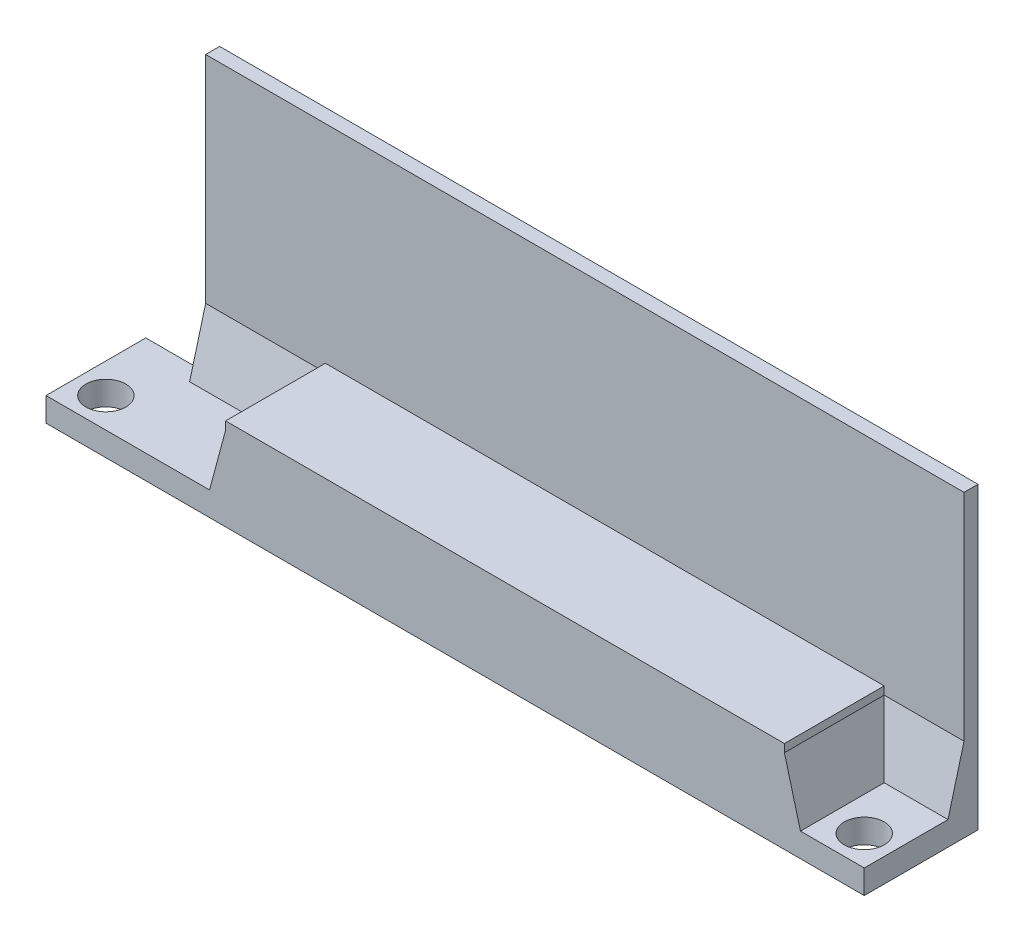
ISO-10303-21;
HEADER;
FILE_DESCRIPTION(('STEP AP214'),'2;1');
FILE_NAME('part.step','',(''),(''),'','','');
FILE_SCHEMA(('AUTOMOTIVE_DESIGN { 1 0 10303 214 1 1 1 1 }'));
ENDSEC;
DATA;
#1=APPLICATION_CONTEXT('core data for automotive mechanical design processes');
#2=APPLICATION_PROTOCOL_DEFINITION('international standard','automotive_design',2000,#1);
#3=PRODUCT_CONTEXT('',#1,'mechanical');
#4=PRODUCT('Part','Part','',(#3));
#5=PRODUCT_RELATED_PRODUCT_CATEGORY('part','',(#4));
#6=PRODUCT_DEFINITION_FORMATION('','',#4);
#7=PRODUCT_DEFINITION_CONTEXT('part definition',#1,'design');
#8=PRODUCT_DEFINITION('design','',#6,#7);
#9=PRODUCT_DEFINITION_SHAPE('','',#8);
#10=(LENGTH_UNIT() NAMED_UNIT(*) SI_UNIT(.MILLI.,.METRE.));
#11=(NAMED_UNIT(*) PLANE_ANGLE_UNIT() SI_UNIT($,.RADIAN.));
#12=(NAMED_UNIT(*) SI_UNIT($,.STERADIAN.) SOLID_ANGLE_UNIT());
#13=UNCERTAINTY_MEASURE_WITH_UNIT(LENGTH_MEASURE(1.E-05),#10,'distance_accuracy_value','');
#14=(GEOMETRIC_REPRESENTATION_CONTEXT(3) GLOBAL_UNCERTAINTY_ASSIGNED_CONTEXT((#13)) GLOBAL_UNIT_ASSIGNED_CONTEXT((#10,
#11,#12)) REPRESENTATION_CONTEXT('',''));
#15=CARTESIAN_POINT('',(0.,0.,0.));
#16=DIRECTION('',(0.,0.,1.));
#17=DIRECTION('',(1.,0.,0.));
#18=AXIS2_PLACEMENT_3D('',#15,#16,#17);
#19=CARTESIAN_POINT('',(9.8,0.,-9.99999999999999));
#20=DIRECTION('',(-1.,0.,0.));
#21=DIRECTION('',(0.,0.,1.));
#22=AXIS2_PLACEMENT_3D('',#19,#20,#21);
#23=PLANE('',#22);
#24=DIRECTION('',(0.,-1.,0.));
#25=VECTOR('',#24,1.);
#26=CARTESIAN_POINT('',(9.8,3.8,-0.799999999999995));
#27=LINE('',#26,#25);
#28=CARTESIAN_POINT('',(9.8,3.8,-0.799999999999995));
#29=VERTEX_POINT('',#28);
#30=CARTESIAN_POINT('',(9.8,0.,-0.799999999999995));
#31=VERTEX_POINT('',#30);
#32=EDGE_CURVE('E74',#29,#31,#27,.T.);
#33=ORIENTED_EDGE('',*,*,#32,.T.);
#34=DIRECTION('',(0.,0.,1.));
#35=VECTOR('',#34,1.);
#36=CARTESIAN_POINT('',(9.8,0.,-9.99999999999999));
#37=LINE('',#36,#35);
#38=CARTESIAN_POINT('',(9.8,0.,-5.70000000000001));
#39=VERTEX_POINT('',#38);
#40=EDGE_CURVE('E188',#39,#31,#37,.T.);
#41=ORIENTED_EDGE('',*,*,#40,.F.);
#42=DIRECTION('',(0.,1.,0.));
#43=VECTOR('',#42,1.);
#44=CARTESIAN_POINT('',(9.8,0.,-5.7));
#45=LINE('',#44,#43);
#46=CARTESIAN_POINT('',(9.8,3.8,-5.70000000000001));
#47=VERTEX_POINT('',#46);
#48=EDGE_CURVE('E190',#39,#47,#45,.T.);
#49=ORIENTED_EDGE('',*,*,#48,.T.);
#50=DIRECTION('',(0.,0.,1.));
#51=VECTOR('',#50,1.);
#52=CARTESIAN_POINT('',(9.8,3.8,-9.99999999999999));
#53=LINE('',#52,#51);
#54=EDGE_CURVE('E241',#47,#29,#53,.T.);
#55=ORIENTED_EDGE('',*,*,#54,.T.);
#56=EDGE_LOOP('',(#33,#41,#49,#55));
#57=FACE_BOUND('',#56,.T.);
#58=ADVANCED_FACE('F55',(#57),#23,.F.);
#59=CARTESIAN_POINT('',(9.8,3.8,-9.99999999999999));
#60=DIRECTION('',(0.,1.,0.));
#61=DIRECTION('',(0.,0.,1.));
#62=AXIS2_PLACEMENT_3D('',#59,#60,#61);
#63=PLANE('',#62);
#64=DIRECTION('',(-1.,0.,0.));
#65=VECTOR('',#64,1.);
#66=CARTESIAN_POINT('',(9.8,3.8,-0.799999999999995));
#67=LINE('',#66,#65);
#68=CARTESIAN_POINT('',(36.2,3.8,-0.799999999999995));
#69=VERTEX_POINT('',#68);
#70=EDGE_CURVE('E82',#69,#29,#67,.T.);
#71=ORIENTED_EDGE('',*,*,#70,.T.);
#72=ORIENTED_EDGE('',*,*,#54,.F.);
#73=DIRECTION('',(1.,0.,0.));
#74=VECTOR('',#73,1.);
#75=CARTESIAN_POINT('',(0.,3.8,-5.7));
#76=LINE('',#75,#74);
#77=CARTESIAN_POINT('',(36.2,3.8,-5.70000000000001));
#78=VERTEX_POINT('',#77);
#79=EDGE_CURVE('E206',#47,#78,#76,.T.);
#80=ORIENTED_EDGE('',*,*,#79,.T.);
#81=DIRECTION('',(0.,0.,1.));
#82=VECTOR('',#81,1.);
#83=CARTESIAN_POINT('',(36.2,3.8,-9.99999999999999));
#84=LINE('',#83,#82);
#85=EDGE_CURVE('E406',#78,#69,#84,.T.);
#86=ORIENTED_EDGE('',*,*,#85,.T.);
#87=EDGE_LOOP('',(#71,#72,#80,#86));
#88=FACE_BOUND('',#87,.T.);
#89=ADVANCED_FACE('F431',(#88),#63,.F.);
#90=CARTESIAN_POINT('',(36.2,0.,-9.99999999999999));
#91=DIRECTION('',(1.,0.,0.));
#92=DIRECTION('',(0.,0.,-1.));
#93=AXIS2_PLACEMENT_3D('',#90,#91,#92);
#94=PLANE('',#93);
#95=DIRECTION('',(0.,1.,0.));
#96=VECTOR('',#95,1.);
#97=CARTESIAN_POINT('',(36.2,3.8,-0.799999999999995));
#98=LINE('',#97,#96);
#99=CARTESIAN_POINT('',(36.2,0.,-0.799999999999995));
#100=VERTEX_POINT('',#99);
#101=EDGE_CURVE('E396',#100,#69,#98,.T.);
#102=ORIENTED_EDGE('',*,*,#101,.T.);
#103=ORIENTED_EDGE('',*,*,#85,.F.);
#104=DIRECTION('',(0.,-1.,0.));
#105=VECTOR('',#104,1.);
#106=CARTESIAN_POINT('',(36.2,0.,-5.70000000000001));
#107=LINE('',#106,#105);
#108=CARTESIAN_POINT('',(36.2,0.,-5.70000000000001));
#109=VERTEX_POINT('',#108);
#110=EDGE_CURVE('E340',#78,#109,#107,.T.);
#111=ORIENTED_EDGE('',*,*,#110,.T.);
#112=DIRECTION('',(0.,0.,1.));
#113=VECTOR('',#112,1.);
#114=CARTESIAN_POINT('',(36.2,0.,-9.99999999999999));
#115=LINE('',#114,#113);
#116=EDGE_CURVE('E196',#109,#100,#115,.T.);
#117=ORIENTED_EDGE('',*,*,#116,.T.);
#118=EDGE_LOOP('',(#102,#103,#111,#117));
#119=FACE_BOUND('',#118,.T.);
#120=ADVANCED_FACE('F413',(#119),#94,.F.);
#121=CARTESIAN_POINT('',(0.,10.,-5.));
#122=DIRECTION('',(0.,0.,1.));
#123=DIRECTION('',(1.,0.,0.));
#124=AXIS2_PLACEMENT_3D('',#121,#122,#123);
#125=PLANE('',#124);
#126=DIRECTION('',(0.,1.,0.));
#127=VECTOR('',#126,1.);
#128=CARTESIAN_POINT('',(3.,15.,-5.));
#129=LINE('',#128,#127);
#130=CARTESIAN_POINT('',(3.,0.,-5.));
#131=VERTEX_POINT('',#130);
#132=CARTESIAN_POINT('',(3.,1.2,-5.));
#133=VERTEX_POINT('',#132);
#134=EDGE_CURVE('E242',#131,#133,#129,.T.);
#135=ORIENTED_EDGE('',*,*,#134,.F.);
#136=DIRECTION('',(-1.,0.,0.));
#137=VECTOR('',#136,1.);
#138=CARTESIAN_POINT('',(0.,0.,-5.));
#139=LINE('',#138,#137);
#140=CARTESIAN_POINT('',(0.,0.,-5.));
#141=VERTEX_POINT('',#140);
#142=EDGE_CURVE('E310',#131,#141,#139,.T.);
#143=ORIENTED_EDGE('',*,*,#142,.T.);
#144=DIRECTION('',(0.,-1.,0.));
#145=VECTOR('',#144,1.);
#146=CARTESIAN_POINT('',(0.,10.,-5.));
#147=LINE('',#146,#145);
#148=CARTESIAN_POINT('',(0.,1.2,-5.));
#149=VERTEX_POINT('',#148);
#150=EDGE_CURVE('E313',#149,#141,#147,.T.);
#151=ORIENTED_EDGE('',*,*,#150,.F.);
#152=DIRECTION('',(1.,0.,0.));
#153=VECTOR('',#152,1.);
#154=CARTESIAN_POINT('',(0.,1.2,-5.));
#155=LINE('',#154,#153);
#156=EDGE_CURVE('E287',#149,#133,#155,.T.);
#157=ORIENTED_EDGE('',*,*,#156,.T.);
#158=EDGE_LOOP('',(#135,#143,#151,#157));
#159=FACE_BOUND('',#158,.T.);
#160=ADVANCED_FACE('F482',(#159),#125,.F.);
#161=CARTESIAN_POINT('',(0.,0.,0.));
#162=DIRECTION('',(0.,-1.,0.));
#163=DIRECTION('',(0.,0.,-1.));
#164=AXIS2_PLACEMENT_3D('',#161,#162,#163);
#165=PLANE('',#164);
#166=ORIENTED_EDGE('',*,*,#116,.F.);
#167=DIRECTION('',(-1.,0.,0.));
#168=VECTOR('',#167,1.);
#169=CARTESIAN_POINT('',(41.,0.,-5.70000000000001));
#170=LINE('',#169,#168);
#171=CARTESIAN_POINT('',(41.,0.,-5.70000000000001));
#172=VERTEX_POINT('',#171);
#173=EDGE_CURVE('E218',#172,#109,#170,.T.);
#174=ORIENTED_EDGE('',*,*,#173,.F.);
#175=DIRECTION('',(0.,0.,-1.));
#176=VECTOR('',#175,1.);
#177=CARTESIAN_POINT('',(41.,0.,0.));
#178=LINE('',#177,#176);
#179=CARTESIAN_POINT('',(41.,0.,0.));
#180=VERTEX_POINT('',#179);
#181=EDGE_CURVE('E307',#180,#172,#178,.T.);
#182=ORIENTED_EDGE('',*,*,#181,.F.);
#183=DIRECTION('',(1.,0.,0.));
#184=VECTOR('',#183,1.);
#185=CARTESIAN_POINT('',(0.,0.,0.));
#186=LINE('',#185,#184);
#187=CARTESIAN_POINT('',(0.,0.,0.));
#188=VERTEX_POINT('',#187);
#189=EDGE_CURVE('E304',#188,#180,#186,.T.);
#190=ORIENTED_EDGE('',*,*,#189,.F.);
#191=DIRECTION('',(0.,0.,1.));
#192=VECTOR('',#191,1.);
#193=CARTESIAN_POINT('',(0.,0.,0.));
#194=LINE('',#193,#192);
#195=EDGE_CURVE('E300',#141,#188,#194,.T.);
#196=ORIENTED_EDGE('',*,*,#195,.F.);
#197=ORIENTED_EDGE('',*,*,#142,.F.);
#198=DIRECTION('',(0.,0.,1.));
#199=VECTOR('',#198,1.);
#200=CARTESIAN_POINT('',(3.,0.,-5.7));
#201=LINE('',#200,#199);
#202=CARTESIAN_POINT('',(3.,0.,-5.7));
#203=VERTEX_POINT('',#202);
#204=EDGE_CURVE('E215',#203,#131,#201,.T.);
#205=ORIENTED_EDGE('',*,*,#204,.F.);
#206=EDGE_CURVE('E202',#39,#203,#170,.T.);
#207=ORIENTED_EDGE('',*,*,#206,.F.);
#208=ORIENTED_EDGE('',*,*,#40,.T.);
#209=DIRECTION('',(1.,0.,0.));
#210=VECTOR('',#209,1.);
#211=CARTESIAN_POINT('',(9.8,0.,-0.799999999999995));
#212=LINE('',#211,#210);
#213=EDGE_CURVE('E400',#31,#100,#212,.T.);
#214=ORIENTED_EDGE('',*,*,#213,.T.);
#215=EDGE_LOOP('',(#166,#174,#182,#190,#196,#197,#205,#207,#208,#214));
#216=FACE_BOUND('',#215,.T.);
#217=CARTESIAN_POINT('',(39.5,0.,-1.5));
#218=DIRECTION('',(0.,1.,0.));
#219=DIRECTION('',(0.,0.,-1.));
#220=AXIS2_PLACEMENT_3D('',#217,#218,#219);
#221=CIRCLE('',#220,1.00000000000001);
#222=CARTESIAN_POINT('',(39.5,0.,-2.50000000000001));
#223=VERTEX_POINT('',#222);
#224=EDGE_CURVE('E291',#223,#223,#221,.T.);
#225=ORIENTED_EDGE('',*,*,#224,.T.);
#226=EDGE_LOOP('',(#225));
#227=FACE_BOUND('',#226,.T.);
#228=CARTESIAN_POINT('',(1.5,0.,-1.5));
#229=DIRECTION('',(0.,1.,0.));
#230=DIRECTION('',(0.,0.,1.));
#231=AXIS2_PLACEMENT_3D('',#228,#229,#230);
#232=CIRCLE('',#231,1.);
#233=CARTESIAN_POINT('',(1.5,0.,-0.500000000000001));
#234=VERTEX_POINT('',#233);
#235=EDGE_CURVE('E296',#234,#234,#232,.T.);
#236=ORIENTED_EDGE('',*,*,#235,.T.);
#237=EDGE_LOOP('',(#236));
#238=FACE_BOUND('',#237,.T.);
#239=ADVANCED_FACE('F211',(#216,#227,#238),#165,.T.);
#240=CARTESIAN_POINT('',(0.,10.,0.));
#241=DIRECTION('',(1.,0.,0.));
#242=DIRECTION('',(0.,0.,-1.));
#243=AXIS2_PLACEMENT_3D('',#240,#241,#242);
#244=PLANE('',#243);
#245=DIRECTION('',(0.,-1.,0.));
#246=VECTOR('',#245,1.);
#247=CARTESIAN_POINT('',(0.,10.,0.));
#248=LINE('',#247,#246);
#249=CARTESIAN_POINT('',(0.,1.2,0.));
#250=VERTEX_POINT('',#249);
#251=EDGE_CURVE('E321',#250,#188,#248,.T.);
#252=ORIENTED_EDGE('',*,*,#251,.F.);
#253=DIRECTION('',(0.,0.,1.));
#254=VECTOR('',#253,1.);
#255=CARTESIAN_POINT('',(0.,1.2,-9.99999999999999));
#256=LINE('',#255,#254);
#257=EDGE_CURVE('E282',#149,#250,#256,.T.);
#258=ORIENTED_EDGE('',*,*,#257,.F.);
#259=ORIENTED_EDGE('',*,*,#150,.T.);
#260=ORIENTED_EDGE('',*,*,#195,.T.);
#261=EDGE_LOOP('',(#252,#258,#259,#260));
#262=FACE_BOUND('',#261,.T.);
#263=ADVANCED_FACE('F481',(#262),#244,.F.);
#264=CARTESIAN_POINT('',(0.,10.,0.));
#265=DIRECTION('',(0.,0.,-1.));
#266=DIRECTION('',(-1.,0.,0.));
#267=AXIS2_PLACEMENT_3D('',#264,#265,#266);
#268=PLANE('',#267);
#269=ORIENTED_EDGE('',*,*,#189,.T.);
#270=DIRECTION('',(0.,-1.,0.));
#271=VECTOR('',#270,1.);
#272=CARTESIAN_POINT('',(41.,10.,0.));
#273=LINE('',#272,#271);
#274=CARTESIAN_POINT('',(41.,1.2,0.));
#275=VERTEX_POINT('',#274);
#276=EDGE_CURVE('E317',#275,#180,#273,.T.);
#277=ORIENTED_EDGE('',*,*,#276,.F.);
#278=DIRECTION('',(1.,0.,0.));
#279=VECTOR('',#278,1.);
#280=CARTESIAN_POINT('',(0.,1.2,0.));
#281=LINE('',#280,#279);
#282=CARTESIAN_POINT('',(37.8038475772934,1.2,0.));
#283=VERTEX_POINT('',#282);
#284=EDGE_CURVE('E260',#283,#275,#281,.T.);
#285=ORIENTED_EDGE('',*,*,#284,.F.);
#286=DIRECTION('',(-0.258819045102527,0.965925826289067,0.));
#287=VECTOR('',#286,1.);
#288=CARTESIAN_POINT('',(33.071469970012,18.8614736709751,0.));
#289=LINE('',#288,#287);
#290=CARTESIAN_POINT('',(37.,4.19999999999995,0.));
#291=VERTEX_POINT('',#290);
#292=EDGE_CURVE('E377',#283,#291,#289,.T.);
#293=ORIENTED_EDGE('',*,*,#292,.T.);
#294=DIRECTION('',(0.,1.,0.));
#295=VECTOR('',#294,1.);
#296=CARTESIAN_POINT('',(37.,0.,0.));
#297=LINE('',#296,#295);
#298=CARTESIAN_POINT('',(37.,4.6,0.));
#299=VERTEX_POINT('',#298);
#300=EDGE_CURVE('E257',#291,#299,#297,.T.);
#301=ORIENTED_EDGE('',*,*,#300,.T.);
#302=DIRECTION('',(1.,0.,0.));
#303=VECTOR('',#302,1.);
#304=CARTESIAN_POINT('',(0.,4.6,0.));
#305=LINE('',#304,#303);
#306=CARTESIAN_POINT('',(9.00000000000001,4.6,0.));
#307=VERTEX_POINT('',#306);
#308=EDGE_CURVE('E268',#307,#299,#305,.T.);
#309=ORIENTED_EDGE('',*,*,#308,.F.);
#310=DIRECTION('',(0.,1.,0.));
#311=VECTOR('',#310,1.);
#312=CARTESIAN_POINT('',(9.00000000000001,0.,0.));
#313=LINE('',#312,#311);
#314=CARTESIAN_POINT('',(9.00000000000001,4.19999999999996,0.));
#315=VERTEX_POINT('',#314);
#316=EDGE_CURVE('E265',#315,#307,#313,.T.);
#317=ORIENTED_EDGE('',*,*,#316,.F.);
#318=DIRECTION('',(0.258819045102524,0.965925826289068,0.));
#319=VECTOR('',#318,1.);
#320=CARTESIAN_POINT('',(9.84711431702999,7.36147367097483,0.));
#321=LINE('',#320,#319);
#322=CARTESIAN_POINT('',(8.19615242270664,1.2,0.));
#323=VERTEX_POINT('',#322);
#324=EDGE_CURVE('E14',#315,#323,#321,.F.);
#325=ORIENTED_EDGE('',*,*,#324,.T.);
#326=EDGE_CURVE('E264',#250,#323,#281,.T.);
#327=ORIENTED_EDGE('',*,*,#326,.F.);
#328=ORIENTED_EDGE('',*,*,#251,.T.);
#329=EDGE_LOOP('',(#269,#277,#285,#293,#301,#309,#317,#325,#327,#328));
#330=FACE_BOUND('',#329,.T.);
#331=ADVANCED_FACE('F488',(#330),#268,.F.);
#332=CARTESIAN_POINT('',(41.,10.,0.));
#333=DIRECTION('',(-1.,0.,0.));
#334=DIRECTION('',(0.,0.,1.));
#335=AXIS2_PLACEMENT_3D('',#332,#333,#334);
#336=PLANE('',#335);
#337=ORIENTED_EDGE('',*,*,#181,.T.);
#338=DIRECTION('',(0.,-1.,0.));
#339=VECTOR('',#338,1.);
#340=CARTESIAN_POINT('',(41.,15.,-5.70000000000001));
#341=LINE('',#340,#339);
#342=CARTESIAN_POINT('',(41.,15.,-5.70000000000001));
#343=VERTEX_POINT('',#342);
#344=EDGE_CURVE('E219',#343,#172,#341,.T.);
#345=ORIENTED_EDGE('',*,*,#344,.F.);
#346=DIRECTION('',(0.,0.,1.));
#347=VECTOR('',#346,1.);
#348=CARTESIAN_POINT('',(41.,15.,-5.70000000000001));
#349=LINE('',#348,#347);
#350=CARTESIAN_POINT('',(41.,15.,-5.));
#351=VERTEX_POINT('',#350);
#352=EDGE_CURVE('E235',#343,#351,#349,.T.);
#353=ORIENTED_EDGE('',*,*,#352,.T.);
#354=DIRECTION('',(0.,-1.,0.));
#355=VECTOR('',#354,1.);
#356=CARTESIAN_POINT('',(41.,15.,-5.));
#357=LINE('',#356,#355);
#358=CARTESIAN_POINT('',(41.,4.19999999999995,-5.));
#359=VERTEX_POINT('',#358);
#360=EDGE_CURVE('E236',#351,#359,#357,.T.);
#361=ORIENTED_EDGE('',*,*,#360,.T.);
#362=DIRECTION('',(0.,0.965925826289067,-0.258819045102527));
#363=VECTOR('',#362,1.);
#364=CARTESIAN_POINT('',(41.,8.36147367097483,-6.11506350946113));
#365=LINE('',#364,#363);
#366=CARTESIAN_POINT('',(41.,1.2,-4.19615242270663));
#367=VERTEX_POINT('',#366);
#368=EDGE_CURVE('E374',#359,#367,#365,.F.);
#369=ORIENTED_EDGE('',*,*,#368,.T.);
#370=DIRECTION('',(0.,0.,1.));
#371=VECTOR('',#370,1.);
#372=CARTESIAN_POINT('',(41.,1.2,-9.99999999999999));
#373=LINE('',#372,#371);
#374=EDGE_CURVE('E272',#367,#275,#373,.T.);
#375=ORIENTED_EDGE('',*,*,#374,.T.);
#376=ORIENTED_EDGE('',*,*,#276,.T.);
#377=EDGE_LOOP('',(#337,#345,#353,#361,#369,#375,#376));
#378=FACE_BOUND('',#377,.T.);
#379=ADVANCED_FACE('F477',(#378),#336,.F.);
#380=CARTESIAN_POINT('',(1.5,10.,-1.5));
#381=DIRECTION('',(0.,-1.,0.));
#382=DIRECTION('',(0.,0.,-1.));
#383=AXIS2_PLACEMENT_3D('',#380,#381,#382);
#384=CYLINDRICAL_SURFACE('',#383,1.);
#385=CARTESIAN_POINT('',(1.5,1.2,-1.5));
#386=DIRECTION('',(0.,-1.,0.));
#387=DIRECTION('',(0.,0.,-1.));
#388=AXIS2_PLACEMENT_3D('',#385,#386,#387);
#389=CIRCLE('',#388,1.);
#390=CARTESIAN_POINT('',(1.5,1.2,-2.5));
#391=VERTEX_POINT('',#390);
#392=EDGE_CURVE('E292',#391,#391,#389,.T.);
#393=ORIENTED_EDGE('',*,*,#392,.F.);
#394=EDGE_LOOP('',(#393));
#395=FACE_BOUND('',#394,.T.);
#396=ORIENTED_EDGE('',*,*,#235,.F.);
#397=EDGE_LOOP('',(#396));
#398=FACE_BOUND('',#397,.T.);
#399=ADVANCED_FACE('F473',(#395,#398),#384,.F.);
#400=CARTESIAN_POINT('',(39.5,10.,-1.5));
#401=DIRECTION('',(0.,-1.,0.));
#402=DIRECTION('',(0.,0.,-1.));
#403=AXIS2_PLACEMENT_3D('',#400,#401,#402);
#404=CYLINDRICAL_SURFACE('',#403,1.00000000000001);
#405=CARTESIAN_POINT('',(39.5,1.2,-1.5));
#406=DIRECTION('',(0.,-1.,0.));
#407=DIRECTION('',(0.,0.,-1.));
#408=AXIS2_PLACEMENT_3D('',#405,#406,#407);
#409=CIRCLE('',#408,1.00000000000001);
#410=CARTESIAN_POINT('',(39.5,1.2,-2.50000000000001));
#411=VERTEX_POINT('',#410);
#412=EDGE_CURVE('E277',#411,#411,#409,.T.);
#413=ORIENTED_EDGE('',*,*,#412,.F.);
#414=EDGE_LOOP('',(#413));
#415=FACE_BOUND('',#414,.T.);
#416=ORIENTED_EDGE('',*,*,#224,.F.);
#417=EDGE_LOOP('',(#416));
#418=FACE_BOUND('',#417,.T.);
#419=ADVANCED_FACE('F469',(#415,#418),#404,.F.);
#420=CARTESIAN_POINT('',(37.,0.,-9.99999999999999));
#421=DIRECTION('',(1.,0.,0.));
#422=DIRECTION('',(0.,0.,-1.));
#423=AXIS2_PLACEMENT_3D('',#420,#421,#422);
#424=PLANE('',#423);
#425=ORIENTED_EDGE('',*,*,#300,.F.);
#426=DIRECTION('',(0.,0.,-1.));
#427=VECTOR('',#426,1.);
#428=CARTESIAN_POINT('',(37.,4.19999999999995,-9.99999999999999));
#429=LINE('',#428,#427);
#430=CARTESIAN_POINT('',(37.,4.19999999999995,-5.));
#431=VERTEX_POINT('',#430);
#432=EDGE_CURVE('E358',#291,#431,#429,.T.);
#433=ORIENTED_EDGE('',*,*,#432,.T.);
#434=DIRECTION('',(0.,1.,0.));
#435=VECTOR('',#434,1.);
#436=CARTESIAN_POINT('',(37.,10.,-5.));
#437=LINE('',#436,#435);
#438=CARTESIAN_POINT('',(37.,4.6,-5.));
#439=VERTEX_POINT('',#438);
#440=EDGE_CURVE('E324',#431,#439,#437,.T.);
#441=ORIENTED_EDGE('',*,*,#440,.T.);
#442=DIRECTION('',(0.,0.,1.));
#443=VECTOR('',#442,1.);
#444=CARTESIAN_POINT('',(37.,4.6,-9.99999999999999));
#445=LINE('',#444,#443);
#446=EDGE_CURVE('E273',#439,#299,#445,.T.);
#447=ORIENTED_EDGE('',*,*,#446,.T.);
#448=EDGE_LOOP('',(#425,#433,#441,#447));
#449=FACE_BOUND('',#448,.T.);
#450=ADVANCED_FACE('F458',(#449),#424,.T.);
#451=CARTESIAN_POINT('',(0.,4.6,-9.99999999999999));
#452=DIRECTION('',(0.,-1.,0.));
#453=DIRECTION('',(0.,0.,-1.));
#454=AXIS2_PLACEMENT_3D('',#451,#452,#453);
#455=PLANE('',#454);
#456=DIRECTION('',(0.,0.,1.));
#457=VECTOR('',#456,1.);
#458=CARTESIAN_POINT('',(9.00000000000001,4.6,-9.99999999999999));
#459=LINE('',#458,#457);
#460=CARTESIAN_POINT('',(9.00000000000001,4.6,-5.));
#461=VERTEX_POINT('',#460);
#462=EDGE_CURVE('E278',#461,#307,#459,.T.);
#463=ORIENTED_EDGE('',*,*,#462,.T.);
#464=ORIENTED_EDGE('',*,*,#308,.T.);
#465=ORIENTED_EDGE('',*,*,#446,.F.);
#466=DIRECTION('',(1.,0.,0.));
#467=VECTOR('',#466,1.);
#468=CARTESIAN_POINT('',(0.,4.6,-5.));
#469=LINE('',#468,#467);
#470=EDGE_CURVE('E333',#461,#439,#469,.T.);
#471=ORIENTED_EDGE('',*,*,#470,.F.);
#472=EDGE_LOOP('',(#463,#464,#465,#471));
#473=FACE_BOUND('',#472,.T.);
#474=ADVANCED_FACE('F454',(#473),#455,.F.);
#475=CARTESIAN_POINT('',(9.00000000000001,0.,-9.99999999999999));
#476=DIRECTION('',(1.,0.,0.));
#477=DIRECTION('',(0.,0.,-1.));
#478=AXIS2_PLACEMENT_3D('',#475,#476,#477);
#479=PLANE('',#478);
#480=DIRECTION('',(0.,1.,0.));
#481=VECTOR('',#480,1.);
#482=CARTESIAN_POINT('',(9.00000000000001,10.,-5.));
#483=LINE('',#482,#481);
#484=CARTESIAN_POINT('',(9.00000000000001,4.19999999999996,-5.));
#485=VERTEX_POINT('',#484);
#486=EDGE_CURVE('E337',#485,#461,#483,.T.);
#487=ORIENTED_EDGE('',*,*,#486,.F.);
#488=DIRECTION('',(0.,0.,1.));
#489=VECTOR('',#488,1.);
#490=CARTESIAN_POINT('',(9.00000000000001,4.19999999999996,0.));
#491=LINE('',#490,#489);
#492=EDGE_CURVE('E371',#485,#315,#491,.T.);
#493=ORIENTED_EDGE('',*,*,#492,.T.);
#494=ORIENTED_EDGE('',*,*,#316,.T.);
#495=ORIENTED_EDGE('',*,*,#462,.F.);
#496=EDGE_LOOP('',(#487,#493,#494,#495));
#497=FACE_BOUND('',#496,.T.);
#498=ADVANCED_FACE('F457',(#497),#479,.F.);
#499=CARTESIAN_POINT('',(0.,1.2,-9.99999999999999));
#500=DIRECTION('',(0.,-1.,0.));
#501=DIRECTION('',(0.,0.,-1.));
#502=AXIS2_PLACEMENT_3D('',#499,#500,#501);
#503=PLANE('',#502);
#504=ORIENTED_EDGE('',*,*,#392,.T.);
#505=EDGE_LOOP('',(#504));
#506=FACE_BOUND('',#505,.T.);
#507=DIRECTION('',(-1.,0.,0.));
#508=VECTOR('',#507,1.);
#509=CARTESIAN_POINT('',(3.,1.2,-4.19615242270663));
#510=LINE('',#509,#508);
#511=CARTESIAN_POINT('',(8.19615242270664,1.2,-4.19615242270663));
#512=VERTEX_POINT('',#511);
#513=CARTESIAN_POINT('',(3.,1.2,-4.19615242270663));
#514=VERTEX_POINT('',#513);
#515=EDGE_CURVE('E364',#512,#514,#510,.T.);
#516=ORIENTED_EDGE('',*,*,#515,.T.);
#517=DIRECTION('',(0.,0.,-1.));
#518=VECTOR('',#517,1.);
#519=CARTESIAN_POINT('',(3.,1.2,-5.7));
#520=LINE('',#519,#518);
#521=EDGE_CURVE('E368',#514,#133,#520,.T.);
#522=ORIENTED_EDGE('',*,*,#521,.T.);
#523=ORIENTED_EDGE('',*,*,#156,.F.);
#524=ORIENTED_EDGE('',*,*,#257,.T.);
#525=ORIENTED_EDGE('',*,*,#326,.T.);
#526=DIRECTION('',(0.,0.,-1.));
#527=VECTOR('',#526,1.);
#528=CARTESIAN_POINT('',(8.19615242270664,1.2,-5.));
#529=LINE('',#528,#527);
#530=EDGE_CURVE('E361',#323,#512,#529,.T.);
#531=ORIENTED_EDGE('',*,*,#530,.T.);
#532=EDGE_LOOP('',(#516,#522,#523,#524,#525,#531));
#533=FACE_BOUND('',#532,.T.);
#534=ADVANCED_FACE('F462',(#506,#533),#503,.F.);
#535=ORIENTED_EDGE('',*,*,#412,.T.);
#536=EDGE_LOOP('',(#535));
#537=FACE_BOUND('',#536,.T.);
#538=ORIENTED_EDGE('',*,*,#374,.F.);
#539=DIRECTION('',(-1.,0.,0.));
#540=VECTOR('',#539,1.);
#541=CARTESIAN_POINT('',(37.,1.2,-4.19615242270663));
#542=LINE('',#541,#540);
#543=CARTESIAN_POINT('',(37.8038475772934,1.2,-4.19615242270663));
#544=VERTEX_POINT('',#543);
#545=EDGE_CURVE('E355',#367,#544,#542,.T.);
#546=ORIENTED_EDGE('',*,*,#545,.T.);
#547=DIRECTION('',(0.,0.,1.));
#548=VECTOR('',#547,1.);
#549=CARTESIAN_POINT('',(37.8038475772934,1.2,-9.99999999999999));
#550=LINE('',#549,#548);
#551=EDGE_CURVE('E352',#544,#283,#550,.T.);
#552=ORIENTED_EDGE('',*,*,#551,.T.);
#553=ORIENTED_EDGE('',*,*,#284,.T.);
#554=EDGE_LOOP('',(#538,#546,#552,#553));
#555=FACE_BOUND('',#554,.T.);
#556=ADVANCED_FACE('F446',(#537,#555),#503,.F.);
#557=CARTESIAN_POINT('',(0.,0.,-5.));
#558=DIRECTION('',(0.,0.,-1.));
#559=DIRECTION('',(-1.,0.,0.));
#560=AXIS2_PLACEMENT_3D('',#557,#558,#559);
#561=PLANE('',#560);
#562=ORIENTED_EDGE('',*,*,#440,.F.);
#563=DIRECTION('',(1.,0.,0.));
#564=VECTOR('',#563,1.);
#565=CARTESIAN_POINT('',(41.,4.19999999999995,-5.));
#566=LINE('',#565,#564);
#567=EDGE_CURVE('E348',#431,#359,#566,.T.);
#568=ORIENTED_EDGE('',*,*,#567,.T.);
#569=ORIENTED_EDGE('',*,*,#360,.F.);
#570=DIRECTION('',(1.,0.,0.));
#571=VECTOR('',#570,1.);
#572=CARTESIAN_POINT('',(41.,15.,-5.));
#573=LINE('',#572,#571);
#574=CARTESIAN_POINT('',(3.,15.,-5.));
#575=VERTEX_POINT('',#574);
#576=EDGE_CURVE('E227',#575,#351,#573,.T.);
#577=ORIENTED_EDGE('',*,*,#576,.F.);
#578=CARTESIAN_POINT('',(3.,4.19999999999996,-5.));
#579=VERTEX_POINT('',#578);
#580=EDGE_CURVE('E240',#579,#575,#129,.T.);
#581=ORIENTED_EDGE('',*,*,#580,.F.);
#582=DIRECTION('',(1.,0.,0.));
#583=VECTOR('',#582,1.);
#584=CARTESIAN_POINT('',(9.00000000000001,4.19999999999996,-5.));
#585=LINE('',#584,#583);
#586=EDGE_CURVE('E208',#579,#485,#585,.T.);
#587=ORIENTED_EDGE('',*,*,#586,.T.);
#588=ORIENTED_EDGE('',*,*,#486,.T.);
#589=ORIENTED_EDGE('',*,*,#470,.T.);
#590=EDGE_LOOP('',(#562,#568,#569,#577,#581,#587,#588,#589));
#591=FACE_BOUND('',#590,.T.);
#592=ADVANCED_FACE('F442',(#591),#561,.F.);
#593=CARTESIAN_POINT('',(3.,15.,-5.7));
#594=DIRECTION('',(1.,0.,0.));
#595=DIRECTION('',(0.,0.,-1.));
#596=AXIS2_PLACEMENT_3D('',#593,#594,#595);
#597=PLANE('',#596);
#598=ORIENTED_EDGE('',*,*,#134,.T.);
#599=ORIENTED_EDGE('',*,*,#521,.F.);
#600=DIRECTION('',(0.,-0.965925826289068,0.258819045102524));
#601=VECTOR('',#600,1.);
#602=CARTESIAN_POINT('',(3.,14.4515371804359,-7.74689110867549));
#603=LINE('',#602,#601);
#604=EDGE_CURVE('E66',#514,#579,#603,.F.);
#605=ORIENTED_EDGE('',*,*,#604,.T.);
#606=ORIENTED_EDGE('',*,*,#580,.T.);
#607=DIRECTION('',(0.,0.,1.));
#608=VECTOR('',#607,1.);
#609=CARTESIAN_POINT('',(3.,15.,-5.7));
#610=LINE('',#609,#608);
#611=CARTESIAN_POINT('',(3.,15.,-5.7));
#612=VERTEX_POINT('',#611);
#613=EDGE_CURVE('E251',#612,#575,#610,.T.);
#614=ORIENTED_EDGE('',*,*,#613,.F.);
#615=DIRECTION('',(0.,1.,0.));
#616=VECTOR('',#615,1.);
#617=CARTESIAN_POINT('',(3.,15.,-5.7));
#618=LINE('',#617,#616);
#619=EDGE_CURVE('E225',#203,#612,#618,.T.);
#620=ORIENTED_EDGE('',*,*,#619,.F.);
#621=ORIENTED_EDGE('',*,*,#204,.T.);
#622=EDGE_LOOP('',(#598,#599,#605,#606,#614,#620,#621));
#623=FACE_BOUND('',#622,.T.);
#624=ADVANCED_FACE('F445',(#623),#597,.F.);
#625=CARTESIAN_POINT('',(41.,15.,-5.70000000000001));
#626=DIRECTION('',(0.,-1.,0.));
#627=DIRECTION('',(0.,0.,-1.));
#628=AXIS2_PLACEMENT_3D('',#625,#626,#627);
#629=PLANE('',#628);
#630=ORIENTED_EDGE('',*,*,#576,.T.);
#631=ORIENTED_EDGE('',*,*,#352,.F.);
#632=DIRECTION('',(1.,0.,0.));
#633=VECTOR('',#632,1.);
#634=CARTESIAN_POINT('',(41.,15.,-5.70000000000001));
#635=LINE('',#634,#633);
#636=EDGE_CURVE('E232',#612,#343,#635,.T.);
#637=ORIENTED_EDGE('',*,*,#636,.F.);
#638=ORIENTED_EDGE('',*,*,#613,.T.);
#639=EDGE_LOOP('',(#630,#631,#637,#638));
#640=FACE_BOUND('',#639,.T.);
#641=ADVANCED_FACE('F441',(#640),#629,.F.);
#642=CARTESIAN_POINT('',(0.,0.,-5.7));
#643=DIRECTION('',(0.,0.,-1.));
#644=DIRECTION('',(-1.,0.,0.));
#645=AXIS2_PLACEMENT_3D('',#642,#643,#644);
#646=PLANE('',#645);
#647=ORIENTED_EDGE('',*,*,#48,.F.);
#648=ORIENTED_EDGE('',*,*,#206,.T.);
#649=ORIENTED_EDGE('',*,*,#619,.T.);
#650=ORIENTED_EDGE('',*,*,#636,.T.);
#651=ORIENTED_EDGE('',*,*,#344,.T.);
#652=ORIENTED_EDGE('',*,*,#173,.T.);
#653=ORIENTED_EDGE('',*,*,#110,.F.);
#654=ORIENTED_EDGE('',*,*,#79,.F.);
#655=EDGE_LOOP('',(#647,#648,#649,#650,#651,#652,#653,#654));
#656=FACE_BOUND('',#655,.T.);
#657=ADVANCED_FACE('F201',(#656),#646,.T.);
#658=CARTESIAN_POINT('',(37.8038475772934,1.2,-9.99999999999999));
#659=DIRECTION('',(-0.965925826289067,-0.258819045102527,0.));
#660=DIRECTION('',(0.,0.,1.));
#661=AXIS2_PLACEMENT_3D('',#658,#659,#660);
#662=PLANE('',#661);
#663=ORIENTED_EDGE('',*,*,#292,.F.);
#664=ORIENTED_EDGE('',*,*,#551,.F.);
#665=DIRECTION('',(0.250562807085737,-0.935113126531026,0.250562807085737));
#666=VECTOR('',#665,1.);
#667=CARTESIAN_POINT('',(34.6770763490967,12.8692690872743,-7.32292365090333));
#668=LINE('',#667,#666);
#669=EDGE_CURVE('E197',#431,#544,#668,.T.);
#670=ORIENTED_EDGE('',*,*,#669,.F.);
#671=ORIENTED_EDGE('',*,*,#432,.F.);
#672=EDGE_LOOP('',(#663,#664,#670,#671));
#673=FACE_BOUND('',#672,.T.);
#674=ADVANCED_FACE('F440',(#673),#662,.F.);
#675=CARTESIAN_POINT('',(0.,4.19999999999995,-5.));
#676=DIRECTION('',(0.,0.258819045102527,0.965925826289067));
#677=DIRECTION('',(-1.,0.,0.));
#678=AXIS2_PLACEMENT_3D('',#675,#676,#677);
#679=PLANE('',#678);
#680=ORIENTED_EDGE('',*,*,#669,.T.);
#681=ORIENTED_EDGE('',*,*,#545,.F.);
#682=ORIENTED_EDGE('',*,*,#368,.F.);
#683=ORIENTED_EDGE('',*,*,#567,.F.);
#684=EDGE_LOOP('',(#680,#681,#682,#683));
#685=FACE_BOUND('',#684,.T.);
#686=ADVANCED_FACE('F497',(#685),#679,.T.);
#687=CARTESIAN_POINT('',(9.00000000000001,4.19999999999996,-9.99999999999999));
#688=DIRECTION('',(-0.965925826289067,0.258819045102524,0.));
#689=DIRECTION('',(0.,0.,-1.));
#690=AXIS2_PLACEMENT_3D('',#687,#688,#689);
#691=PLANE('',#690);
#692=ORIENTED_EDGE('',*,*,#324,.F.);
#693=ORIENTED_EDGE('',*,*,#492,.F.);
#694=DIRECTION('',(-0.250562807085735,-0.935113126531028,0.250562807085735));
#695=VECTOR('',#694,1.);
#696=CARTESIAN_POINT('',(8.43496451734786,2.09125887066297,-4.43496451734786));
#697=LINE('',#696,#695);
#698=EDGE_CURVE('E60',#512,#485,#697,.F.);
#699=ORIENTED_EDGE('',*,*,#698,.F.);
#700=ORIENTED_EDGE('',*,*,#530,.F.);
#701=EDGE_LOOP('',(#692,#693,#699,#700));
#702=FACE_BOUND('',#701,.T.);
#703=ADVANCED_FACE('F58',(#702),#691,.T.);
#704=CARTESIAN_POINT('',(0.,4.19999999999996,-5.));
#705=DIRECTION('',(0.,0.258819045102524,0.965925826289067));
#706=DIRECTION('',(-1.,0.,0.));
#707=AXIS2_PLACEMENT_3D('',#704,#705,#706);
#708=PLANE('',#707);
#709=ORIENTED_EDGE('',*,*,#604,.F.);
#710=ORIENTED_EDGE('',*,*,#515,.F.);
#711=ORIENTED_EDGE('',*,*,#698,.T.);
#712=ORIENTED_EDGE('',*,*,#586,.F.);
#713=EDGE_LOOP('',(#709,#710,#711,#712));
#714=FACE_BOUND('',#713,.T.);
#715=ADVANCED_FACE('F424',(#714),#708,.T.);
#716=CARTESIAN_POINT('',(0.,0.,-0.799999999999995));
#717=DIRECTION('',(0.,0.,1.));
#718=DIRECTION('',(1.,0.,0.));
#719=AXIS2_PLACEMENT_3D('',#716,#717,#718);
#720=PLANE('',#719);
#721=ORIENTED_EDGE('',*,*,#32,.F.);
#722=ORIENTED_EDGE('',*,*,#70,.F.);
#723=ORIENTED_EDGE('',*,*,#101,.F.);
#724=ORIENTED_EDGE('',*,*,#213,.F.);
#725=EDGE_LOOP('',(#721,#722,#723,#724));
#726=FACE_BOUND('',#725,.T.);
#727=ADVANCED_FACE('F416',(#726),#720,.F.);
#728=CLOSED_SHELL('',(#58,#89,#120,#160,#239,#263,#331,#379,#399,#419,#450,#474,#498,#534,#556,
#592,#624,#641,#657,#674,#686,#703,#715,#727));
#729=MANIFOLD_SOLID_BREP('B2',#728);
#730=ADVANCED_BREP_SHAPE_REPRESENTATION('',(#18,#729),#14);
#731=SHAPE_DEFINITION_REPRESENTATION(#9,#730);
ENDSEC;
END-ISO-10303-21;
